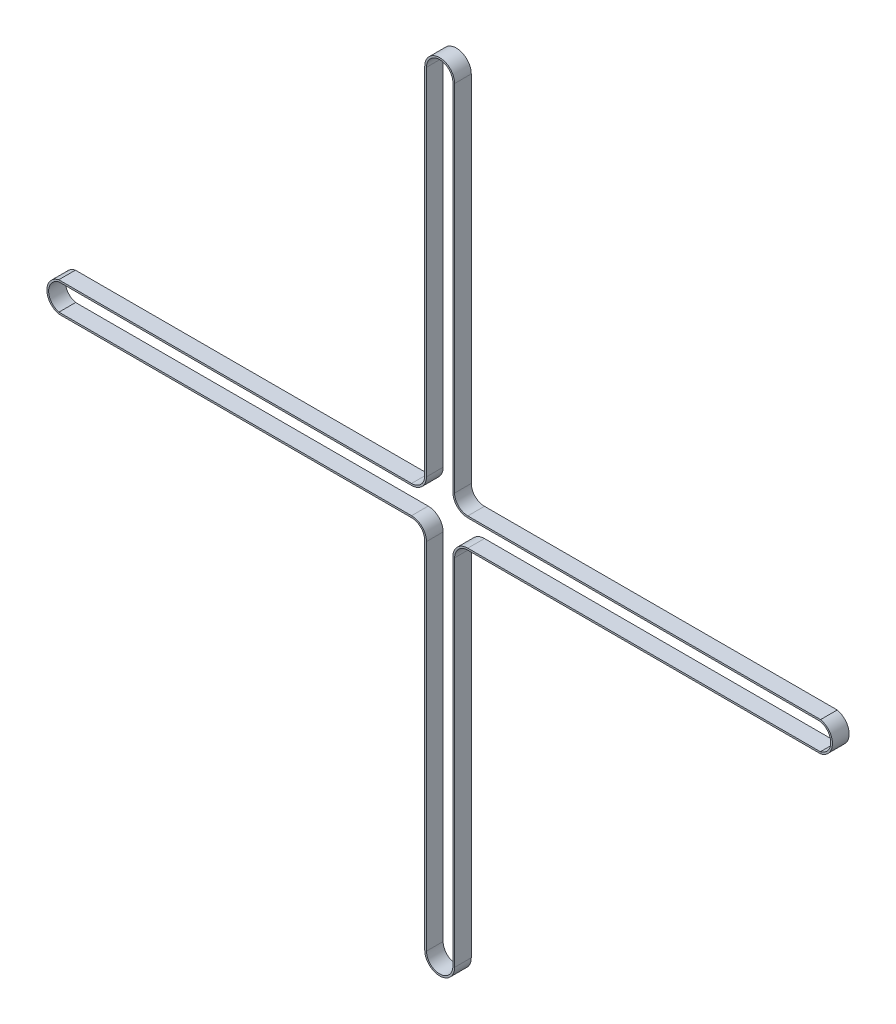
ISO-10303-21;
HEADER;
FILE_DESCRIPTION(('STEP AP214'),'2;1');
FILE_NAME('part.step','',(''),(''),'','','');
FILE_SCHEMA(('AUTOMOTIVE_DESIGN { 1 0 10303 214 1 1 1 1 }'));
ENDSEC;
DATA;
#1=APPLICATION_CONTEXT('core data for automotive mechanical design processes');
#2=APPLICATION_PROTOCOL_DEFINITION('international standard','automotive_design',2000,#1);
#3=PRODUCT_CONTEXT('',#1,'mechanical');
#4=PRODUCT('Part','Part','',(#3));
#5=PRODUCT_RELATED_PRODUCT_CATEGORY('part','',(#4));
#6=PRODUCT_DEFINITION_FORMATION('','',#4);
#7=PRODUCT_DEFINITION_CONTEXT('part definition',#1,'design');
#8=PRODUCT_DEFINITION('design','',#6,#7);
#9=PRODUCT_DEFINITION_SHAPE('','',#8);
#10=(LENGTH_UNIT() NAMED_UNIT(*) SI_UNIT(.MILLI.,.METRE.));
#11=(NAMED_UNIT(*) PLANE_ANGLE_UNIT() SI_UNIT($,.RADIAN.));
#12=(NAMED_UNIT(*) SI_UNIT($,.STERADIAN.) SOLID_ANGLE_UNIT());
#13=UNCERTAINTY_MEASURE_WITH_UNIT(LENGTH_MEASURE(1.E-05),#10,'distance_accuracy_value','');
#14=(GEOMETRIC_REPRESENTATION_CONTEXT(3) GLOBAL_UNCERTAINTY_ASSIGNED_CONTEXT((#13)) GLOBAL_UNIT_ASSIGNED_CONTEXT((#10,
#11,#12)) REPRESENTATION_CONTEXT('',''));
#15=CARTESIAN_POINT('',(0.,0.,0.));
#16=DIRECTION('',(0.,0.,1.));
#17=DIRECTION('',(1.,0.,0.));
#18=AXIS2_PLACEMENT_3D('',#15,#16,#17);
#19=CARTESIAN_POINT('',(0.,7.69421433221935,6.));
#20=DIRECTION('',(0.,0.,-1.));
#21=DIRECTION('',(-1.,0.,0.));
#22=AXIS2_PLACEMENT_3D('',#19,#20,#21);
#23=PLANE('',#22);
#24=CARTESIAN_POINT('',(0.,7.69421433221935,6.));
#25=DIRECTION('',(0.,0.,1.));
#26=DIRECTION('',(-1.,0.,0.));
#27=AXIS2_PLACEMENT_3D('',#24,#25,#26);
#28=CIRCLE('',#27,5.37999999999999);
#29=CARTESIAN_POINT('',(5.37999999999997,7.69421433221935,6.));
#30=VERTEX_POINT('',#29);
#31=CARTESIAN_POINT('',(-5.38,7.69421433221935,6.));
#32=VERTEX_POINT('',#31);
#33=EDGE_CURVE('E420',#30,#32,#28,.T.);
#34=ORIENTED_EDGE('',*,*,#33,.T.);
#35=DIRECTION('',(0.,-1.,0.));
#36=VECTOR('',#35,1.);
#37=CARTESIAN_POINT('',(-5.38,7.69421433221935,6.));
#38=LINE('',#37,#36);
#39=CARTESIAN_POINT('',(-5.38000000000002,-120.055785667781,6.));
#40=VERTEX_POINT('',#39);
#41=EDGE_CURVE('E424',#32,#40,#38,.T.);
#42=ORIENTED_EDGE('',*,*,#41,.T.);
#43=CARTESIAN_POINT('',(-10.13,-120.055785667781,6.));
#44=DIRECTION('',(0.,0.,-1.));
#45=DIRECTION('',(-1.,0.,0.));
#46=AXIS2_PLACEMENT_3D('',#43,#44,#45);
#47=CIRCLE('',#46,4.74999999999998);
#48=CARTESIAN_POINT('',(-10.13,-124.805785667781,6.));
#49=VERTEX_POINT('',#48);
#50=EDGE_CURVE('E428',#40,#49,#47,.T.);
#51=ORIENTED_EDGE('',*,*,#50,.T.);
#52=DIRECTION('',(-1.,0.,0.));
#53=VECTOR('',#52,1.);
#54=CARTESIAN_POINT('',(-10.13,-124.805785667781,6.));
#55=LINE('',#54,#53);
#56=CARTESIAN_POINT('',(-137.202114627931,-124.805785667781,6.));
#57=VERTEX_POINT('',#56);
#58=EDGE_CURVE('E431',#49,#57,#55,.T.);
#59=ORIENTED_EDGE('',*,*,#58,.T.);
#60=CARTESIAN_POINT('',(-136.,-130.152309811681,6.));
#61=DIRECTION('',(0.,0.,1.));
#62=DIRECTION('',(1.,0.,0.));
#63=AXIS2_PLACEMENT_3D('',#60,#61,#62);
#64=CIRCLE('',#63,5.48);
#65=CARTESIAN_POINT('',(-137.202114627931,-135.498833955582,6.));
#66=VERTEX_POINT('',#65);
#67=EDGE_CURVE('E434',#57,#66,#64,.T.);
#68=ORIENTED_EDGE('',*,*,#67,.T.);
#69=DIRECTION('',(1.,0.,0.));
#70=VECTOR('',#69,1.);
#71=CARTESIAN_POINT('',(-10.13,-135.498833955582,6.));
#72=LINE('',#71,#70);
#73=CARTESIAN_POINT('',(-10.13,-135.498833955582,6.));
#74=VERTEX_POINT('',#73);
#75=EDGE_CURVE('E437',#66,#74,#72,.T.);
#76=ORIENTED_EDGE('',*,*,#75,.T.);
#77=CARTESIAN_POINT('',(-10.13,-140.248833955582,6.));
#78=DIRECTION('',(0.,0.,-1.));
#79=DIRECTION('',(1.,0.,0.));
#80=AXIS2_PLACEMENT_3D('',#77,#78,#79);
#81=CIRCLE('',#80,4.75000000000002);
#82=CARTESIAN_POINT('',(-5.37999999999996,-140.248833955582,6.));
#83=VERTEX_POINT('',#82);
#84=EDGE_CURVE('E440',#74,#83,#81,.T.);
#85=ORIENTED_EDGE('',*,*,#84,.T.);
#86=DIRECTION('',(0.,-1.,0.));
#87=VECTOR('',#86,1.);
#88=CARTESIAN_POINT('',(-5.38000000000003,-267.998833955582,6.));
#89=LINE('',#88,#87);
#90=CARTESIAN_POINT('',(-5.38000000000003,-267.998833955582,6.));
#91=VERTEX_POINT('',#90);
#92=EDGE_CURVE('E443',#83,#91,#89,.T.);
#93=ORIENTED_EDGE('',*,*,#92,.T.);
#94=CARTESIAN_POINT('',(0.,-267.998833955582,6.));
#95=DIRECTION('',(0.,0.,1.));
#96=DIRECTION('',(1.,0.,0.));
#97=AXIS2_PLACEMENT_3D('',#94,#95,#96);
#98=CIRCLE('',#97,5.38000000000003);
#99=CARTESIAN_POINT('',(5.38000000000007,-267.998833955582,6.));
#100=VERTEX_POINT('',#99);
#101=EDGE_CURVE('E446',#91,#100,#98,.T.);
#102=ORIENTED_EDGE('',*,*,#101,.T.);
#103=DIRECTION('',(0.,1.,0.));
#104=VECTOR('',#103,1.);
#105=CARTESIAN_POINT('',(5.38000000000003,-267.998833955582,6.));
#106=LINE('',#105,#104);
#107=CARTESIAN_POINT('',(5.38000000000001,-140.248833955582,6.));
#108=VERTEX_POINT('',#107);
#109=EDGE_CURVE('E449',#100,#108,#106,.T.);
#110=ORIENTED_EDGE('',*,*,#109,.T.);
#111=CARTESIAN_POINT('',(10.13,-140.248833955582,6.));
#112=DIRECTION('',(0.,0.,-1.));
#113=DIRECTION('',(-1.,0.,0.));
#114=AXIS2_PLACEMENT_3D('',#111,#112,#113);
#115=CIRCLE('',#114,4.75000000000001);
#116=CARTESIAN_POINT('',(10.13,-135.498833955582,6.));
#117=VERTEX_POINT('',#116);
#118=EDGE_CURVE('E452',#108,#117,#115,.T.);
#119=ORIENTED_EDGE('',*,*,#118,.T.);
#120=DIRECTION('',(1.,0.,0.));
#121=VECTOR('',#120,1.);
#122=CARTESIAN_POINT('',(10.13,-135.498833955582,6.));
#123=LINE('',#122,#121);
#124=CARTESIAN_POINT('',(137.202114627931,-135.498833955582,6.));
#125=VERTEX_POINT('',#124);
#126=EDGE_CURVE('E455',#117,#125,#123,.T.);
#127=ORIENTED_EDGE('',*,*,#126,.T.);
#128=CARTESIAN_POINT('',(136.,-130.152309811681,6.));
#129=DIRECTION('',(0.,0.,1.));
#130=DIRECTION('',(-1.,0.,0.));
#131=AXIS2_PLACEMENT_3D('',#128,#129,#130);
#132=CIRCLE('',#131,5.47999999999999);
#133=CARTESIAN_POINT('',(137.202114627931,-124.805785667781,6.));
#134=VERTEX_POINT('',#133);
#135=EDGE_CURVE('E458',#125,#134,#132,.T.);
#136=ORIENTED_EDGE('',*,*,#135,.T.);
#137=DIRECTION('',(-1.,0.,0.));
#138=VECTOR('',#137,1.);
#139=CARTESIAN_POINT('',(10.13,-124.805785667781,6.));
#140=LINE('',#139,#138);
#141=CARTESIAN_POINT('',(10.13,-124.805785667781,6.));
#142=VERTEX_POINT('',#141);
#143=EDGE_CURVE('E461',#134,#142,#140,.T.);
#144=ORIENTED_EDGE('',*,*,#143,.T.);
#145=CARTESIAN_POINT('',(10.13,-120.055785667781,6.));
#146=DIRECTION('',(0.,0.,-1.));
#147=DIRECTION('',(1.,0.,0.));
#148=AXIS2_PLACEMENT_3D('',#145,#146,#147);
#149=CIRCLE('',#148,4.75000000000001);
#150=CARTESIAN_POINT('',(5.38000000000001,-120.055785667781,6.));
#151=VERTEX_POINT('',#150);
#152=EDGE_CURVE('E464',#142,#151,#149,.T.);
#153=ORIENTED_EDGE('',*,*,#152,.T.);
#154=DIRECTION('',(0.,1.,0.));
#155=VECTOR('',#154,1.);
#156=CARTESIAN_POINT('',(5.37999999999997,7.69421433221935,6.));
#157=LINE('',#156,#155);
#158=EDGE_CURVE('E467',#151,#30,#157,.T.);
#159=ORIENTED_EDGE('',*,*,#158,.T.);
#160=EDGE_LOOP('',(#34,#42,#51,#59,#68,#76,#85,#93,#102,#110,#119,#127,#136,#144,#153,#159));
#161=FACE_BOUND('',#160,.T.);
#162=CARTESIAN_POINT('',(0.,7.69421433221935,6.));
#163=DIRECTION('',(0.,0.,1.));
#164=DIRECTION('',(-1.,0.,0.));
#165=AXIS2_PLACEMENT_3D('',#162,#163,#164);
#166=CIRCLE('',#165,4.75);
#167=CARTESIAN_POINT('',(4.75,7.69421433221935,6.));
#168=VERTEX_POINT('',#167);
#169=CARTESIAN_POINT('',(-4.75,7.69421433221935,6.));
#170=VERTEX_POINT('',#169);
#171=EDGE_CURVE('E251',#168,#170,#166,.T.);
#172=ORIENTED_EDGE('',*,*,#171,.F.);
#173=DIRECTION('',(0.,1.,0.));
#174=VECTOR('',#173,1.);
#175=CARTESIAN_POINT('',(4.75,7.69421433221935,6.));
#176=LINE('',#175,#174);
#177=CARTESIAN_POINT('',(4.75000000000005,-120.055785667781,6.));
#178=VERTEX_POINT('',#177);
#179=EDGE_CURVE('E316',#178,#168,#176,.T.);
#180=ORIENTED_EDGE('',*,*,#179,.F.);
#181=CARTESIAN_POINT('',(10.13,-120.055785667781,6.));
#182=DIRECTION('',(0.,0.,-1.));
#183=DIRECTION('',(1.,0.,0.));
#184=AXIS2_PLACEMENT_3D('',#181,#182,#183);
#185=CIRCLE('',#184,5.37999999999998);
#186=CARTESIAN_POINT('',(10.13,-125.435785667781,6.));
#187=VERTEX_POINT('',#186);
#188=EDGE_CURVE('E313',#187,#178,#185,.T.);
#189=ORIENTED_EDGE('',*,*,#188,.F.);
#190=DIRECTION('',(-1.,0.,0.));
#191=VECTOR('',#190,1.);
#192=CARTESIAN_POINT('',(10.13,-125.435785667781,6.));
#193=LINE('',#192,#191);
#194=CARTESIAN_POINT('',(137.13,-125.43578566778,6.));
#195=VERTEX_POINT('',#194);
#196=EDGE_CURVE('E310',#195,#187,#193,.T.);
#197=ORIENTED_EDGE('',*,*,#196,.F.);
#198=CARTESIAN_POINT('',(136.,-130.152309811681,6.));
#199=DIRECTION('',(0.,0.,1.));
#200=DIRECTION('',(-1.,0.,0.));
#201=AXIS2_PLACEMENT_3D('',#198,#199,#200);
#202=CIRCLE('',#201,4.84999999999998);
#203=CARTESIAN_POINT('',(137.13,-134.868833955582,6.));
#204=VERTEX_POINT('',#203);
#205=EDGE_CURVE('E307',#204,#195,#202,.T.);
#206=ORIENTED_EDGE('',*,*,#205,.F.);
#207=DIRECTION('',(1.,0.,0.));
#208=VECTOR('',#207,1.);
#209=CARTESIAN_POINT('',(10.13,-134.868833955582,6.));
#210=LINE('',#209,#208);
#211=CARTESIAN_POINT('',(10.13,-134.868833955582,6.));
#212=VERTEX_POINT('',#211);
#213=EDGE_CURVE('E304',#212,#204,#210,.T.);
#214=ORIENTED_EDGE('',*,*,#213,.F.);
#215=CARTESIAN_POINT('',(10.13,-140.248833955582,6.));
#216=DIRECTION('',(0.,0.,-1.));
#217=DIRECTION('',(-1.,0.,0.));
#218=AXIS2_PLACEMENT_3D('',#215,#216,#217);
#219=CIRCLE('',#218,5.38);
#220=CARTESIAN_POINT('',(4.75000000000005,-140.248833955582,6.));
#221=VERTEX_POINT('',#220);
#222=EDGE_CURVE('E301',#221,#212,#219,.T.);
#223=ORIENTED_EDGE('',*,*,#222,.F.);
#224=DIRECTION('',(0.,1.,0.));
#225=VECTOR('',#224,1.);
#226=CARTESIAN_POINT('',(4.75000000000004,-267.998833955582,6.));
#227=LINE('',#226,#225);
#228=CARTESIAN_POINT('',(4.75000000000003,-267.998833955582,6.));
#229=VERTEX_POINT('',#228);
#230=EDGE_CURVE('E298',#229,#221,#227,.T.);
#231=ORIENTED_EDGE('',*,*,#230,.F.);
#232=CARTESIAN_POINT('',(0.,-267.998833955582,6.));
#233=DIRECTION('',(0.,0.,1.));
#234=DIRECTION('',(1.,0.,0.));
#235=AXIS2_PLACEMENT_3D('',#232,#233,#234);
#236=CIRCLE('',#235,4.75);
#237=CARTESIAN_POINT('',(-4.74999999999997,-267.998833955582,6.));
#238=VERTEX_POINT('',#237);
#239=EDGE_CURVE('E295',#238,#229,#236,.T.);
#240=ORIENTED_EDGE('',*,*,#239,.F.);
#241=DIRECTION('',(0.,-1.,0.));
#242=VECTOR('',#241,1.);
#243=CARTESIAN_POINT('',(-4.74999999999997,-267.998833955582,6.));
#244=LINE('',#243,#242);
#245=CARTESIAN_POINT('',(-4.74999999999998,-140.248833955582,6.));
#246=VERTEX_POINT('',#245);
#247=EDGE_CURVE('E292',#246,#238,#244,.T.);
#248=ORIENTED_EDGE('',*,*,#247,.F.);
#249=CARTESIAN_POINT('',(-10.13,-140.248833955582,6.));
#250=DIRECTION('',(0.,0.,-1.));
#251=DIRECTION('',(1.,0.,0.));
#252=AXIS2_PLACEMENT_3D('',#249,#250,#251);
#253=CIRCLE('',#252,5.38);
#254=CARTESIAN_POINT('',(-10.13,-134.868833955582,6.));
#255=VERTEX_POINT('',#254);
#256=EDGE_CURVE('E289',#255,#246,#253,.T.);
#257=ORIENTED_EDGE('',*,*,#256,.F.);
#258=DIRECTION('',(1.,0.,0.));
#259=VECTOR('',#258,1.);
#260=CARTESIAN_POINT('',(-10.13,-134.868833955582,6.));
#261=LINE('',#260,#259);
#262=CARTESIAN_POINT('',(-137.13,-134.868833955582,6.));
#263=VERTEX_POINT('',#262);
#264=EDGE_CURVE('E286',#263,#255,#261,.T.);
#265=ORIENTED_EDGE('',*,*,#264,.F.);
#266=CARTESIAN_POINT('',(-136.,-130.152309811681,6.));
#267=DIRECTION('',(0.,0.,1.));
#268=DIRECTION('',(1.,0.,0.));
#269=AXIS2_PLACEMENT_3D('',#266,#267,#268);
#270=CIRCLE('',#269,4.84999999999998);
#271=CARTESIAN_POINT('',(-137.13,-125.435785667781,6.));
#272=VERTEX_POINT('',#271);
#273=EDGE_CURVE('E283',#272,#263,#270,.T.);
#274=ORIENTED_EDGE('',*,*,#273,.F.);
#275=DIRECTION('',(-1.,0.,0.));
#276=VECTOR('',#275,1.);
#277=CARTESIAN_POINT('',(-10.13,-125.435785667781,6.));
#278=LINE('',#277,#276);
#279=CARTESIAN_POINT('',(-10.13,-125.435785667781,6.));
#280=VERTEX_POINT('',#279);
#281=EDGE_CURVE('E278',#280,#272,#278,.T.);
#282=ORIENTED_EDGE('',*,*,#281,.F.);
#283=CARTESIAN_POINT('',(-10.13,-120.055785667781,6.));
#284=DIRECTION('',(0.,0.,-1.));
#285=DIRECTION('',(-1.,0.,0.));
#286=AXIS2_PLACEMENT_3D('',#283,#284,#285);
#287=CIRCLE('',#286,5.37999999999998);
#288=CARTESIAN_POINT('',(-4.75000000000002,-120.055785667781,6.));
#289=VERTEX_POINT('',#288);
#290=EDGE_CURVE('E274',#289,#280,#287,.T.);
#291=ORIENTED_EDGE('',*,*,#290,.F.);
#292=DIRECTION('',(0.,-1.,0.));
#293=VECTOR('',#292,1.);
#294=CARTESIAN_POINT('',(-4.75,7.69421433221935,6.));
#295=LINE('',#294,#293);
#296=EDGE_CURVE('E260',#170,#289,#295,.T.);
#297=ORIENTED_EDGE('',*,*,#296,.F.);
#298=EDGE_LOOP('',(#172,#180,#189,#197,#206,#214,#223,#231,#240,#248,#257,#265,#274,#282,#291,#297));
#299=FACE_BOUND('',#298,.T.);
#300=ADVANCED_FACE('F41',(#161,#299),#23,.F.);
#301=CARTESIAN_POINT('',(0.,7.69421433221935,0.));
#302=DIRECTION('',(0.,0.,-1.));
#303=DIRECTION('',(-1.,0.,0.));
#304=AXIS2_PLACEMENT_3D('',#301,#302,#303);
#305=PLANE('',#304);
#306=CARTESIAN_POINT('',(0.,7.69421433221935,0.));
#307=DIRECTION('',(0.,0.,1.));
#308=DIRECTION('',(-1.,0.,0.));
#309=AXIS2_PLACEMENT_3D('',#306,#307,#308);
#310=CIRCLE('',#309,5.37999999999999);
#311=CARTESIAN_POINT('',(5.37999999999997,7.69421433221935,0.));
#312=VERTEX_POINT('',#311);
#313=CARTESIAN_POINT('',(-5.38,7.69421433221935,0.));
#314=VERTEX_POINT('',#313);
#315=EDGE_CURVE('E269',#312,#314,#310,.T.);
#316=ORIENTED_EDGE('',*,*,#315,.F.);
#317=DIRECTION('',(0.,1.,0.));
#318=VECTOR('',#317,1.);
#319=CARTESIAN_POINT('',(5.37999999999997,7.69421433221935,0.));
#320=LINE('',#319,#318);
#321=CARTESIAN_POINT('',(5.38000000000001,-120.055785667781,0.));
#322=VERTEX_POINT('',#321);
#323=EDGE_CURVE('E425',#322,#312,#320,.T.);
#324=ORIENTED_EDGE('',*,*,#323,.F.);
#325=CARTESIAN_POINT('',(10.13,-120.055785667781,0.));
#326=DIRECTION('',(0.,0.,-1.));
#327=DIRECTION('',(1.,0.,0.));
#328=AXIS2_PLACEMENT_3D('',#325,#326,#327);
#329=CIRCLE('',#328,4.75000000000001);
#330=CARTESIAN_POINT('',(10.13,-124.805785667781,0.));
#331=VERTEX_POINT('',#330);
#332=EDGE_CURVE('E513',#331,#322,#329,.T.);
#333=ORIENTED_EDGE('',*,*,#332,.F.);
#334=DIRECTION('',(-1.,0.,0.));
#335=VECTOR('',#334,1.);
#336=CARTESIAN_POINT('',(10.13,-124.805785667781,0.));
#337=LINE('',#336,#335);
#338=CARTESIAN_POINT('',(137.202114627931,-124.805785667781,0.));
#339=VERTEX_POINT('',#338);
#340=EDGE_CURVE('E510',#339,#331,#337,.T.);
#341=ORIENTED_EDGE('',*,*,#340,.F.);
#342=CARTESIAN_POINT('',(136.,-130.152309811681,0.));
#343=DIRECTION('',(0.,0.,1.));
#344=DIRECTION('',(-1.,0.,0.));
#345=AXIS2_PLACEMENT_3D('',#342,#343,#344);
#346=CIRCLE('',#345,5.47999999999999);
#347=CARTESIAN_POINT('',(137.202114627931,-135.498833955582,0.));
#348=VERTEX_POINT('',#347);
#349=EDGE_CURVE('E507',#348,#339,#346,.T.);
#350=ORIENTED_EDGE('',*,*,#349,.F.);
#351=DIRECTION('',(1.,0.,0.));
#352=VECTOR('',#351,1.);
#353=CARTESIAN_POINT('',(10.13,-135.498833955582,0.));
#354=LINE('',#353,#352);
#355=CARTESIAN_POINT('',(10.13,-135.498833955582,0.));
#356=VERTEX_POINT('',#355);
#357=EDGE_CURVE('E504',#356,#348,#354,.T.);
#358=ORIENTED_EDGE('',*,*,#357,.F.);
#359=CARTESIAN_POINT('',(10.13,-140.248833955582,0.));
#360=DIRECTION('',(0.,0.,-1.));
#361=DIRECTION('',(-1.,0.,0.));
#362=AXIS2_PLACEMENT_3D('',#359,#360,#361);
#363=CIRCLE('',#362,4.75000000000001);
#364=CARTESIAN_POINT('',(5.38000000000001,-140.248833955582,0.));
#365=VERTEX_POINT('',#364);
#366=EDGE_CURVE('E501',#365,#356,#363,.T.);
#367=ORIENTED_EDGE('',*,*,#366,.F.);
#368=DIRECTION('',(0.,1.,0.));
#369=VECTOR('',#368,1.);
#370=CARTESIAN_POINT('',(5.38000000000003,-267.998833955582,0.));
#371=LINE('',#370,#369);
#372=CARTESIAN_POINT('',(5.38000000000007,-267.998833955582,0.));
#373=VERTEX_POINT('',#372);
#374=EDGE_CURVE('E498',#373,#365,#371,.T.);
#375=ORIENTED_EDGE('',*,*,#374,.F.);
#376=CARTESIAN_POINT('',(0.,-267.998833955582,0.));
#377=DIRECTION('',(0.,0.,1.));
#378=DIRECTION('',(1.,0.,0.));
#379=AXIS2_PLACEMENT_3D('',#376,#377,#378);
#380=CIRCLE('',#379,5.38000000000003);
#381=CARTESIAN_POINT('',(-5.38000000000003,-267.998833955582,0.));
#382=VERTEX_POINT('',#381);
#383=EDGE_CURVE('E495',#382,#373,#380,.T.);
#384=ORIENTED_EDGE('',*,*,#383,.F.);
#385=DIRECTION('',(0.,-1.,0.));
#386=VECTOR('',#385,1.);
#387=CARTESIAN_POINT('',(-5.38000000000003,-267.998833955582,0.));
#388=LINE('',#387,#386);
#389=CARTESIAN_POINT('',(-5.37999999999996,-140.248833955582,0.));
#390=VERTEX_POINT('',#389);
#391=EDGE_CURVE('E492',#390,#382,#388,.T.);
#392=ORIENTED_EDGE('',*,*,#391,.F.);
#393=CARTESIAN_POINT('',(-10.13,-140.248833955582,0.));
#394=DIRECTION('',(0.,0.,-1.));
#395=DIRECTION('',(1.,0.,0.));
#396=AXIS2_PLACEMENT_3D('',#393,#394,#395);
#397=CIRCLE('',#396,4.75000000000002);
#398=CARTESIAN_POINT('',(-10.13,-135.498833955582,0.));
#399=VERTEX_POINT('',#398);
#400=EDGE_CURVE('E489',#399,#390,#397,.T.);
#401=ORIENTED_EDGE('',*,*,#400,.F.);
#402=DIRECTION('',(1.,0.,0.));
#403=VECTOR('',#402,1.);
#404=CARTESIAN_POINT('',(-10.13,-135.498833955582,0.));
#405=LINE('',#404,#403);
#406=CARTESIAN_POINT('',(-137.202114627931,-135.498833955582,0.));
#407=VERTEX_POINT('',#406);
#408=EDGE_CURVE('E486',#407,#399,#405,.T.);
#409=ORIENTED_EDGE('',*,*,#408,.F.);
#410=CARTESIAN_POINT('',(-136.,-130.152309811681,0.));
#411=DIRECTION('',(0.,0.,1.));
#412=DIRECTION('',(1.,0.,0.));
#413=AXIS2_PLACEMENT_3D('',#410,#411,#412);
#414=CIRCLE('',#413,5.48);
#415=CARTESIAN_POINT('',(-137.202114627931,-124.805785667781,0.));
#416=VERTEX_POINT('',#415);
#417=EDGE_CURVE('E483',#416,#407,#414,.T.);
#418=ORIENTED_EDGE('',*,*,#417,.F.);
#419=DIRECTION('',(-1.,0.,0.));
#420=VECTOR('',#419,1.);
#421=CARTESIAN_POINT('',(-10.13,-124.805785667781,0.));
#422=LINE('',#421,#420);
#423=CARTESIAN_POINT('',(-10.13,-124.805785667781,0.));
#424=VERTEX_POINT('',#423);
#425=EDGE_CURVE('E480',#424,#416,#422,.T.);
#426=ORIENTED_EDGE('',*,*,#425,.F.);
#427=CARTESIAN_POINT('',(-10.13,-120.055785667781,0.));
#428=DIRECTION('',(0.,0.,-1.));
#429=DIRECTION('',(-1.,0.,0.));
#430=AXIS2_PLACEMENT_3D('',#427,#428,#429);
#431=CIRCLE('',#430,4.74999999999998);
#432=CARTESIAN_POINT('',(-5.38000000000002,-120.055785667781,0.));
#433=VERTEX_POINT('',#432);
#434=EDGE_CURVE('E477',#433,#424,#431,.T.);
#435=ORIENTED_EDGE('',*,*,#434,.F.);
#436=DIRECTION('',(0.,-1.,0.));
#437=VECTOR('',#436,1.);
#438=CARTESIAN_POINT('',(-5.38,7.69421433221935,0.));
#439=LINE('',#438,#437);
#440=EDGE_CURVE('E474',#314,#433,#439,.T.);
#441=ORIENTED_EDGE('',*,*,#440,.F.);
#442=EDGE_LOOP('',(#316,#324,#333,#341,#350,#358,#367,#375,#384,#392,#401,#409,#418,#426,#435,#441));
#443=FACE_BOUND('',#442,.T.);
#444=DIRECTION('',(0.,1.,0.));
#445=VECTOR('',#444,1.);
#446=CARTESIAN_POINT('',(4.75,7.69421433221935,0.));
#447=LINE('',#446,#445);
#448=CARTESIAN_POINT('',(4.75000000000003,-120.055785667781,0.));
#449=VERTEX_POINT('',#448);
#450=CARTESIAN_POINT('',(4.75,7.69421433221935,0.));
#451=VERTEX_POINT('',#450);
#452=EDGE_CURVE('E261',#449,#451,#447,.T.);
#453=ORIENTED_EDGE('',*,*,#452,.T.);
#454=CARTESIAN_POINT('',(0.,7.69421433221935,0.));
#455=DIRECTION('',(0.,0.,1.));
#456=DIRECTION('',(-1.,0.,0.));
#457=AXIS2_PLACEMENT_3D('',#454,#455,#456);
#458=CIRCLE('',#457,4.75);
#459=CARTESIAN_POINT('',(-4.75,7.69421433221935,0.));
#460=VERTEX_POINT('',#459);
#461=EDGE_CURVE('E65',#451,#460,#458,.T.);
#462=ORIENTED_EDGE('',*,*,#461,.T.);
#463=DIRECTION('',(0.,-1.,0.));
#464=VECTOR('',#463,1.);
#465=CARTESIAN_POINT('',(-4.75,7.69421433221935,0.));
#466=LINE('',#465,#464);
#467=CARTESIAN_POINT('',(-4.75000000000002,-120.055785667781,0.));
#468=VERTEX_POINT('',#467);
#469=EDGE_CURVE('E267',#460,#468,#466,.T.);
#470=ORIENTED_EDGE('',*,*,#469,.T.);
#471=CARTESIAN_POINT('',(-10.13,-120.055785667781,0.));
#472=DIRECTION('',(0.,0.,-1.));
#473=DIRECTION('',(-1.,0.,0.));
#474=AXIS2_PLACEMENT_3D('',#471,#472,#473);
#475=CIRCLE('',#474,5.37999999999998);
#476=CARTESIAN_POINT('',(-10.13,-125.435785667781,0.));
#477=VERTEX_POINT('',#476);
#478=EDGE_CURVE('E323',#468,#477,#475,.T.);
#479=ORIENTED_EDGE('',*,*,#478,.T.);
#480=DIRECTION('',(-1.,0.,0.));
#481=VECTOR('',#480,1.);
#482=CARTESIAN_POINT('',(-10.13,-125.435785667781,0.));
#483=LINE('',#482,#481);
#484=CARTESIAN_POINT('',(-137.13,-125.435785667781,0.));
#485=VERTEX_POINT('',#484);
#486=EDGE_CURVE('E327',#477,#485,#483,.T.);
#487=ORIENTED_EDGE('',*,*,#486,.T.);
#488=CARTESIAN_POINT('',(-136.,-130.152309811681,0.));
#489=DIRECTION('',(0.,0.,1.));
#490=DIRECTION('',(1.,0.,0.));
#491=AXIS2_PLACEMENT_3D('',#488,#489,#490);
#492=CIRCLE('',#491,4.84999999999998);
#493=CARTESIAN_POINT('',(-137.13,-134.868833955582,0.));
#494=VERTEX_POINT('',#493);
#495=EDGE_CURVE('E331',#485,#494,#492,.T.);
#496=ORIENTED_EDGE('',*,*,#495,.T.);
#497=DIRECTION('',(1.,0.,0.));
#498=VECTOR('',#497,1.);
#499=CARTESIAN_POINT('',(-10.13,-134.868833955582,0.));
#500=LINE('',#499,#498);
#501=CARTESIAN_POINT('',(-10.13,-134.868833955582,0.));
#502=VERTEX_POINT('',#501);
#503=EDGE_CURVE('E335',#494,#502,#500,.T.);
#504=ORIENTED_EDGE('',*,*,#503,.T.);
#505=CARTESIAN_POINT('',(-10.13,-140.248833955582,0.));
#506=DIRECTION('',(0.,0.,-1.));
#507=DIRECTION('',(1.,0.,0.));
#508=AXIS2_PLACEMENT_3D('',#505,#506,#507);
#509=CIRCLE('',#508,5.38);
#510=CARTESIAN_POINT('',(-4.74999999999998,-140.248833955582,0.));
#511=VERTEX_POINT('',#510);
#512=EDGE_CURVE('E339',#502,#511,#509,.T.);
#513=ORIENTED_EDGE('',*,*,#512,.T.);
#514=DIRECTION('',(0.,-1.,0.));
#515=VECTOR('',#514,1.);
#516=CARTESIAN_POINT('',(-4.74999999999997,-267.998833955582,0.));
#517=LINE('',#516,#515);
#518=CARTESIAN_POINT('',(-4.74999999999997,-267.998833955582,0.));
#519=VERTEX_POINT('',#518);
#520=EDGE_CURVE('E343',#511,#519,#517,.T.);
#521=ORIENTED_EDGE('',*,*,#520,.T.);
#522=CARTESIAN_POINT('',(0.,-267.998833955582,0.));
#523=DIRECTION('',(0.,0.,1.));
#524=DIRECTION('',(1.,0.,0.));
#525=AXIS2_PLACEMENT_3D('',#522,#523,#524);
#526=CIRCLE('',#525,4.75);
#527=CARTESIAN_POINT('',(4.75000000000003,-267.998833955582,0.));
#528=VERTEX_POINT('',#527);
#529=EDGE_CURVE('E347',#519,#528,#526,.T.);
#530=ORIENTED_EDGE('',*,*,#529,.T.);
#531=DIRECTION('',(0.,1.,0.));
#532=VECTOR('',#531,1.);
#533=CARTESIAN_POINT('',(4.75000000000004,-267.998833955582,0.));
#534=LINE('',#533,#532);
#535=CARTESIAN_POINT('',(4.75000000000005,-140.248833955582,0.));
#536=VERTEX_POINT('',#535);
#537=EDGE_CURVE('E351',#528,#536,#534,.T.);
#538=ORIENTED_EDGE('',*,*,#537,.T.);
#539=CARTESIAN_POINT('',(10.13,-140.248833955582,0.));
#540=DIRECTION('',(0.,0.,-1.));
#541=DIRECTION('',(-1.,0.,0.));
#542=AXIS2_PLACEMENT_3D('',#539,#540,#541);
#543=CIRCLE('',#542,5.38);
#544=CARTESIAN_POINT('',(10.13,-134.868833955582,0.));
#545=VERTEX_POINT('',#544);
#546=EDGE_CURVE('E355',#536,#545,#543,.T.);
#547=ORIENTED_EDGE('',*,*,#546,.T.);
#548=DIRECTION('',(1.,0.,0.));
#549=VECTOR('',#548,1.);
#550=CARTESIAN_POINT('',(10.13,-134.868833955582,0.));
#551=LINE('',#550,#549);
#552=CARTESIAN_POINT('',(137.13,-134.868833955582,0.));
#553=VERTEX_POINT('',#552);
#554=EDGE_CURVE('E359',#545,#553,#551,.T.);
#555=ORIENTED_EDGE('',*,*,#554,.T.);
#556=CARTESIAN_POINT('',(136.,-130.152309811681,0.));
#557=DIRECTION('',(0.,0.,1.));
#558=DIRECTION('',(-1.,0.,0.));
#559=AXIS2_PLACEMENT_3D('',#556,#557,#558);
#560=CIRCLE('',#559,4.84999999999998);
#561=CARTESIAN_POINT('',(137.13,-125.43578566778,0.));
#562=VERTEX_POINT('',#561);
#563=EDGE_CURVE('E363',#553,#562,#560,.T.);
#564=ORIENTED_EDGE('',*,*,#563,.T.);
#565=DIRECTION('',(-1.,0.,0.));
#566=VECTOR('',#565,1.);
#567=CARTESIAN_POINT('',(10.13,-125.435785667781,0.));
#568=LINE('',#567,#566);
#569=CARTESIAN_POINT('',(10.13,-125.435785667781,0.));
#570=VERTEX_POINT('',#569);
#571=EDGE_CURVE('E367',#562,#570,#568,.T.);
#572=ORIENTED_EDGE('',*,*,#571,.T.);
#573=CARTESIAN_POINT('',(10.13,-120.055785667781,0.));
#574=DIRECTION('',(0.,0.,-1.));
#575=DIRECTION('',(1.,0.,0.));
#576=AXIS2_PLACEMENT_3D('',#573,#574,#575);
#577=CIRCLE('',#576,5.37999999999998);
#578=EDGE_CURVE('E371',#570,#449,#577,.T.);
#579=ORIENTED_EDGE('',*,*,#578,.T.);
#580=EDGE_LOOP('',(#453,#462,#470,#479,#487,#496,#504,#513,#521,#530,#538,#547,#555,#564,#572,#579));
#581=FACE_BOUND('',#580,.T.);
#582=ADVANCED_FACE('F584',(#443,#581),#305,.T.);
#583=CARTESIAN_POINT('',(0.,7.69421433221935,6.));
#584=DIRECTION('',(0.,0.,-1.));
#585=DIRECTION('',(-1.,0.,0.));
#586=AXIS2_PLACEMENT_3D('',#583,#584,#585);
#587=CYLINDRICAL_SURFACE('',#586,5.37999999999999);
#588=ORIENTED_EDGE('',*,*,#315,.T.);
#589=DIRECTION('',(0.,0.,-1.));
#590=VECTOR('',#589,1.);
#591=CARTESIAN_POINT('',(-5.38,7.69421433221935,6.));
#592=LINE('',#591,#590);
#593=EDGE_CURVE('E11',#32,#314,#592,.T.);
#594=ORIENTED_EDGE('',*,*,#593,.F.);
#595=ORIENTED_EDGE('',*,*,#33,.F.);
#596=DIRECTION('',(0.,0.,-1.));
#597=VECTOR('',#596,1.);
#598=CARTESIAN_POINT('',(5.37999999999997,7.69421433221935,6.));
#599=LINE('',#598,#597);
#600=EDGE_CURVE('E470',#30,#312,#599,.T.);
#601=ORIENTED_EDGE('',*,*,#600,.T.);
#602=EDGE_LOOP('',(#588,#594,#595,#601));
#603=FACE_BOUND('',#602,.T.);
#604=ADVANCED_FACE('F43',(#603),#587,.T.);
#605=CARTESIAN_POINT('',(-5.38,7.69421433221935,6.));
#606=DIRECTION('',(1.,0.,0.));
#607=DIRECTION('',(0.,1.,0.));
#608=AXIS2_PLACEMENT_3D('',#605,#606,#607);
#609=PLANE('',#608);
#610=ORIENTED_EDGE('',*,*,#440,.T.);
#611=DIRECTION('',(0.,0.,-1.));
#612=VECTOR('',#611,1.);
#613=CARTESIAN_POINT('',(-5.38000000000002,-120.055785667781,6.));
#614=LINE('',#613,#612);
#615=EDGE_CURVE('E50',#40,#433,#614,.T.);
#616=ORIENTED_EDGE('',*,*,#615,.F.);
#617=ORIENTED_EDGE('',*,*,#41,.F.);
#618=ORIENTED_EDGE('',*,*,#593,.T.);
#619=EDGE_LOOP('',(#610,#616,#617,#618));
#620=FACE_BOUND('',#619,.T.);
#621=ADVANCED_FACE('F601',(#620),#609,.F.);
#622=CARTESIAN_POINT('',(-10.13,-120.055785667781,6.));
#623=DIRECTION('',(0.,0.,-1.));
#624=DIRECTION('',(-1.,0.,0.));
#625=AXIS2_PLACEMENT_3D('',#622,#623,#624);
#626=CYLINDRICAL_SURFACE('',#625,4.74999999999998);
#627=ORIENTED_EDGE('',*,*,#434,.T.);
#628=DIRECTION('',(0.,0.,-1.));
#629=VECTOR('',#628,1.);
#630=CARTESIAN_POINT('',(-10.13,-124.805785667781,6.));
#631=LINE('',#630,#629);
#632=EDGE_CURVE('E569',#49,#424,#631,.T.);
#633=ORIENTED_EDGE('',*,*,#632,.F.);
#634=ORIENTED_EDGE('',*,*,#50,.F.);
#635=ORIENTED_EDGE('',*,*,#615,.T.);
#636=EDGE_LOOP('',(#627,#633,#634,#635));
#637=FACE_BOUND('',#636,.T.);
#638=ADVANCED_FACE('F578',(#637),#626,.F.);
#639=CARTESIAN_POINT('',(-10.13,-124.805785667781,6.));
#640=DIRECTION('',(0.,-1.,0.));
#641=DIRECTION('',(0.,0.,-1.));
#642=AXIS2_PLACEMENT_3D('',#639,#640,#641);
#643=PLANE('',#642);
#644=ORIENTED_EDGE('',*,*,#425,.T.);
#645=DIRECTION('',(0.,0.,-1.));
#646=VECTOR('',#645,1.);
#647=CARTESIAN_POINT('',(-137.202114627931,-124.805785667781,6.));
#648=LINE('',#647,#646);
#649=EDGE_CURVE('E565',#57,#416,#648,.T.);
#650=ORIENTED_EDGE('',*,*,#649,.F.);
#651=ORIENTED_EDGE('',*,*,#58,.F.);
#652=ORIENTED_EDGE('',*,*,#632,.T.);
#653=EDGE_LOOP('',(#644,#650,#651,#652));
#654=FACE_BOUND('',#653,.T.);
#655=ADVANCED_FACE('F590',(#654),#643,.F.);
#656=CARTESIAN_POINT('',(-136.,-130.152309811681,6.));
#657=DIRECTION('',(0.,0.,-1.));
#658=DIRECTION('',(-1.,0.,0.));
#659=AXIS2_PLACEMENT_3D('',#656,#657,#658);
#660=CYLINDRICAL_SURFACE('',#659,5.48);
#661=ORIENTED_EDGE('',*,*,#417,.T.);
#662=DIRECTION('',(0.,0.,-1.));
#663=VECTOR('',#662,1.);
#664=CARTESIAN_POINT('',(-137.202114627931,-135.498833955582,6.));
#665=LINE('',#664,#663);
#666=EDGE_CURVE('E561',#66,#407,#665,.T.);
#667=ORIENTED_EDGE('',*,*,#666,.F.);
#668=ORIENTED_EDGE('',*,*,#67,.F.);
#669=ORIENTED_EDGE('',*,*,#649,.T.);
#670=EDGE_LOOP('',(#661,#667,#668,#669));
#671=FACE_BOUND('',#670,.T.);
#672=ADVANCED_FACE('F594',(#671),#660,.T.);
#673=CARTESIAN_POINT('',(-10.13,-135.498833955582,6.));
#674=DIRECTION('',(0.,1.,0.));
#675=DIRECTION('',(-1.,0.,0.));
#676=AXIS2_PLACEMENT_3D('',#673,#674,#675);
#677=PLANE('',#676);
#678=ORIENTED_EDGE('',*,*,#408,.T.);
#679=DIRECTION('',(0.,0.,-1.));
#680=VECTOR('',#679,1.);
#681=CARTESIAN_POINT('',(-10.13,-135.498833955582,6.));
#682=LINE('',#681,#680);
#683=EDGE_CURVE('E557',#74,#399,#682,.T.);
#684=ORIENTED_EDGE('',*,*,#683,.F.);
#685=ORIENTED_EDGE('',*,*,#75,.F.);
#686=ORIENTED_EDGE('',*,*,#666,.T.);
#687=EDGE_LOOP('',(#678,#684,#685,#686));
#688=FACE_BOUND('',#687,.T.);
#689=ADVANCED_FACE('F654',(#688),#677,.F.);
#690=CARTESIAN_POINT('',(-10.13,-140.248833955582,6.));
#691=DIRECTION('',(0.,0.,-1.));
#692=DIRECTION('',(-1.,0.,0.));
#693=AXIS2_PLACEMENT_3D('',#690,#691,#692);
#694=CYLINDRICAL_SURFACE('',#693,4.75000000000002);
#695=ORIENTED_EDGE('',*,*,#400,.T.);
#696=DIRECTION('',(0.,0.,-1.));
#697=VECTOR('',#696,1.);
#698=CARTESIAN_POINT('',(-5.37999999999996,-140.248833955582,6.));
#699=LINE('',#698,#697);
#700=EDGE_CURVE('E553',#83,#390,#699,.T.);
#701=ORIENTED_EDGE('',*,*,#700,.F.);
#702=ORIENTED_EDGE('',*,*,#84,.F.);
#703=ORIENTED_EDGE('',*,*,#683,.T.);
#704=EDGE_LOOP('',(#695,#701,#702,#703));
#705=FACE_BOUND('',#704,.T.);
#706=ADVANCED_FACE('F651',(#705),#694,.F.);
#707=CARTESIAN_POINT('',(-5.38000000000003,-267.998833955582,6.));
#708=DIRECTION('',(1.,0.,0.));
#709=DIRECTION('',(0.,1.,0.));
#710=AXIS2_PLACEMENT_3D('',#707,#708,#709);
#711=PLANE('',#710);
#712=ORIENTED_EDGE('',*,*,#391,.T.);
#713=DIRECTION('',(0.,0.,-1.));
#714=VECTOR('',#713,1.);
#715=CARTESIAN_POINT('',(-5.38000000000003,-267.998833955582,6.));
#716=LINE('',#715,#714);
#717=EDGE_CURVE('E549',#91,#382,#716,.T.);
#718=ORIENTED_EDGE('',*,*,#717,.F.);
#719=ORIENTED_EDGE('',*,*,#92,.F.);
#720=ORIENTED_EDGE('',*,*,#700,.T.);
#721=EDGE_LOOP('',(#712,#718,#719,#720));
#722=FACE_BOUND('',#721,.T.);
#723=ADVANCED_FACE('F647',(#722),#711,.F.);
#724=CARTESIAN_POINT('',(0.,-267.998833955582,6.));
#725=DIRECTION('',(0.,0.,-1.));
#726=DIRECTION('',(-1.,0.,0.));
#727=AXIS2_PLACEMENT_3D('',#724,#725,#726);
#728=CYLINDRICAL_SURFACE('',#727,5.38000000000003);
#729=ORIENTED_EDGE('',*,*,#383,.T.);
#730=DIRECTION('',(0.,0.,-1.));
#731=VECTOR('',#730,1.);
#732=CARTESIAN_POINT('',(5.38000000000007,-267.998833955582,6.));
#733=LINE('',#732,#731);
#734=EDGE_CURVE('E545',#100,#373,#733,.T.);
#735=ORIENTED_EDGE('',*,*,#734,.F.);
#736=ORIENTED_EDGE('',*,*,#101,.F.);
#737=ORIENTED_EDGE('',*,*,#717,.T.);
#738=EDGE_LOOP('',(#729,#735,#736,#737));
#739=FACE_BOUND('',#738,.T.);
#740=ADVANCED_FACE('F643',(#739),#728,.T.);
#741=CARTESIAN_POINT('',(5.38000000000003,-267.998833955582,6.));
#742=DIRECTION('',(-1.,0.,0.));
#743=DIRECTION('',(0.,-1.,0.));
#744=AXIS2_PLACEMENT_3D('',#741,#742,#743);
#745=PLANE('',#744);
#746=ORIENTED_EDGE('',*,*,#374,.T.);
#747=DIRECTION('',(0.,0.,-1.));
#748=VECTOR('',#747,1.);
#749=CARTESIAN_POINT('',(5.38000000000001,-140.248833955582,6.));
#750=LINE('',#749,#748);
#751=EDGE_CURVE('E541',#108,#365,#750,.T.);
#752=ORIENTED_EDGE('',*,*,#751,.F.);
#753=ORIENTED_EDGE('',*,*,#109,.F.);
#754=ORIENTED_EDGE('',*,*,#734,.T.);
#755=EDGE_LOOP('',(#746,#752,#753,#754));
#756=FACE_BOUND('',#755,.T.);
#757=ADVANCED_FACE('F638',(#756),#745,.F.);
#758=CARTESIAN_POINT('',(10.13,-140.248833955582,6.));
#759=DIRECTION('',(0.,0.,-1.));
#760=DIRECTION('',(-1.,0.,0.));
#761=AXIS2_PLACEMENT_3D('',#758,#759,#760);
#762=CYLINDRICAL_SURFACE('',#761,4.75000000000001);
#763=ORIENTED_EDGE('',*,*,#366,.T.);
#764=DIRECTION('',(0.,0.,-1.));
#765=VECTOR('',#764,1.);
#766=CARTESIAN_POINT('',(10.13,-135.498833955582,6.));
#767=LINE('',#766,#765);
#768=EDGE_CURVE('E537',#117,#356,#767,.T.);
#769=ORIENTED_EDGE('',*,*,#768,.F.);
#770=ORIENTED_EDGE('',*,*,#118,.F.);
#771=ORIENTED_EDGE('',*,*,#751,.T.);
#772=EDGE_LOOP('',(#763,#769,#770,#771));
#773=FACE_BOUND('',#772,.T.);
#774=ADVANCED_FACE('F632',(#773),#762,.F.);
#775=CARTESIAN_POINT('',(10.13,-135.498833955582,6.));
#776=DIRECTION('',(0.,1.,0.));
#777=DIRECTION('',(-1.,0.,0.));
#778=AXIS2_PLACEMENT_3D('',#775,#776,#777);
#779=PLANE('',#778);
#780=ORIENTED_EDGE('',*,*,#357,.T.);
#781=DIRECTION('',(0.,0.,-1.));
#782=VECTOR('',#781,1.);
#783=CARTESIAN_POINT('',(137.202114627931,-135.498833955582,6.));
#784=LINE('',#783,#782);
#785=EDGE_CURVE('E533',#125,#348,#784,.T.);
#786=ORIENTED_EDGE('',*,*,#785,.F.);
#787=ORIENTED_EDGE('',*,*,#126,.F.);
#788=ORIENTED_EDGE('',*,*,#768,.T.);
#789=EDGE_LOOP('',(#780,#786,#787,#788));
#790=FACE_BOUND('',#789,.T.);
#791=ADVANCED_FACE('F628',(#790),#779,.F.);
#792=CARTESIAN_POINT('',(136.,-130.152309811681,6.));
#793=DIRECTION('',(0.,0.,-1.));
#794=DIRECTION('',(-1.,0.,0.));
#795=AXIS2_PLACEMENT_3D('',#792,#793,#794);
#796=CYLINDRICAL_SURFACE('',#795,5.47999999999999);
#797=ORIENTED_EDGE('',*,*,#349,.T.);
#798=DIRECTION('',(0.,0.,-1.));
#799=VECTOR('',#798,1.);
#800=CARTESIAN_POINT('',(137.202114627931,-124.805785667781,6.));
#801=LINE('',#800,#799);
#802=EDGE_CURVE('E529',#134,#339,#801,.T.);
#803=ORIENTED_EDGE('',*,*,#802,.F.);
#804=ORIENTED_EDGE('',*,*,#135,.F.);
#805=ORIENTED_EDGE('',*,*,#785,.T.);
#806=EDGE_LOOP('',(#797,#803,#804,#805));
#807=FACE_BOUND('',#806,.T.);
#808=ADVANCED_FACE('F623',(#807),#796,.T.);
#809=CARTESIAN_POINT('',(10.13,-124.805785667781,6.));
#810=DIRECTION('',(0.,-1.,0.));
#811=DIRECTION('',(1.,0.,0.));
#812=AXIS2_PLACEMENT_3D('',#809,#810,#811);
#813=PLANE('',#812);
#814=ORIENTED_EDGE('',*,*,#340,.T.);
#815=DIRECTION('',(0.,0.,-1.));
#816=VECTOR('',#815,1.);
#817=CARTESIAN_POINT('',(10.13,-124.805785667781,6.));
#818=LINE('',#817,#816);
#819=EDGE_CURVE('E525',#142,#331,#818,.T.);
#820=ORIENTED_EDGE('',*,*,#819,.F.);
#821=ORIENTED_EDGE('',*,*,#143,.F.);
#822=ORIENTED_EDGE('',*,*,#802,.T.);
#823=EDGE_LOOP('',(#814,#820,#821,#822));
#824=FACE_BOUND('',#823,.T.);
#825=ADVANCED_FACE('F617',(#824),#813,.F.);
#826=CARTESIAN_POINT('',(10.13,-120.055785667781,6.));
#827=DIRECTION('',(0.,0.,-1.));
#828=DIRECTION('',(-1.,0.,0.));
#829=AXIS2_PLACEMENT_3D('',#826,#827,#828);
#830=CYLINDRICAL_SURFACE('',#829,4.75000000000001);
#831=ORIENTED_EDGE('',*,*,#332,.T.);
#832=DIRECTION('',(0.,0.,-1.));
#833=VECTOR('',#832,1.);
#834=CARTESIAN_POINT('',(5.38000000000001,-120.055785667781,6.));
#835=LINE('',#834,#833);
#836=EDGE_CURVE('E521',#151,#322,#835,.T.);
#837=ORIENTED_EDGE('',*,*,#836,.F.);
#838=ORIENTED_EDGE('',*,*,#152,.F.);
#839=ORIENTED_EDGE('',*,*,#819,.T.);
#840=EDGE_LOOP('',(#831,#837,#838,#839));
#841=FACE_BOUND('',#840,.T.);
#842=ADVANCED_FACE('F613',(#841),#830,.F.);
#843=CARTESIAN_POINT('',(5.37999999999997,7.69421433221935,6.));
#844=DIRECTION('',(-1.,0.,0.));
#845=DIRECTION('',(0.,-1.,0.));
#846=AXIS2_PLACEMENT_3D('',#843,#844,#845);
#847=PLANE('',#846);
#848=ORIENTED_EDGE('',*,*,#323,.T.);
#849=ORIENTED_EDGE('',*,*,#600,.F.);
#850=ORIENTED_EDGE('',*,*,#158,.F.);
#851=ORIENTED_EDGE('',*,*,#836,.T.);
#852=EDGE_LOOP('',(#848,#849,#850,#851));
#853=FACE_BOUND('',#852,.T.);
#854=ADVANCED_FACE('F608',(#853),#847,.F.);
#855=CARTESIAN_POINT('',(0.,7.69421433221935,6.));
#856=DIRECTION('',(0.,0.,-1.));
#857=DIRECTION('',(-1.,0.,0.));
#858=AXIS2_PLACEMENT_3D('',#855,#856,#857);
#859=CYLINDRICAL_SURFACE('',#858,4.75);
#860=ORIENTED_EDGE('',*,*,#461,.F.);
#861=DIRECTION('',(0.,0.,-1.));
#862=VECTOR('',#861,1.);
#863=CARTESIAN_POINT('',(4.75,7.69421433221935,6.));
#864=LINE('',#863,#862);
#865=EDGE_CURVE('E255',#168,#451,#864,.T.);
#866=ORIENTED_EDGE('',*,*,#865,.F.);
#867=ORIENTED_EDGE('',*,*,#171,.T.);
#868=DIRECTION('',(0.,0.,-1.));
#869=VECTOR('',#868,1.);
#870=CARTESIAN_POINT('',(-4.75,7.69421433221935,6.));
#871=LINE('',#870,#869);
#872=EDGE_CURVE('E254',#170,#460,#871,.T.);
#873=ORIENTED_EDGE('',*,*,#872,.T.);
#874=EDGE_LOOP('',(#860,#866,#867,#873));
#875=FACE_BOUND('',#874,.T.);
#876=ADVANCED_FACE('F253',(#875),#859,.F.);
#877=CARTESIAN_POINT('',(-4.75,7.69421433221935,6.));
#878=DIRECTION('',(1.,0.,0.));
#879=DIRECTION('',(0.,1.,0.));
#880=AXIS2_PLACEMENT_3D('',#877,#878,#879);
#881=PLANE('',#880);
#882=ORIENTED_EDGE('',*,*,#469,.F.);
#883=ORIENTED_EDGE('',*,*,#872,.F.);
#884=ORIENTED_EDGE('',*,*,#296,.T.);
#885=DIRECTION('',(0.,0.,-1.));
#886=VECTOR('',#885,1.);
#887=CARTESIAN_POINT('',(-4.75000000000002,-120.055785667781,6.));
#888=LINE('',#887,#886);
#889=EDGE_CURVE('E270',#289,#468,#888,.T.);
#890=ORIENTED_EDGE('',*,*,#889,.T.);
#891=EDGE_LOOP('',(#882,#883,#884,#890));
#892=FACE_BOUND('',#891,.T.);
#893=ADVANCED_FACE('F264',(#892),#881,.T.);
#894=CARTESIAN_POINT('',(-10.13,-120.055785667781,6.));
#895=DIRECTION('',(0.,0.,-1.));
#896=DIRECTION('',(-1.,0.,0.));
#897=AXIS2_PLACEMENT_3D('',#894,#895,#896);
#898=CYLINDRICAL_SURFACE('',#897,5.37999999999998);
#899=ORIENTED_EDGE('',*,*,#478,.F.);
#900=ORIENTED_EDGE('',*,*,#889,.F.);
#901=ORIENTED_EDGE('',*,*,#290,.T.);
#902=DIRECTION('',(0.,0.,-1.));
#903=VECTOR('',#902,1.);
#904=CARTESIAN_POINT('',(-10.13,-125.435785667781,6.));
#905=LINE('',#904,#903);
#906=EDGE_CURVE('E415',#280,#477,#905,.T.);
#907=ORIENTED_EDGE('',*,*,#906,.T.);
#908=EDGE_LOOP('',(#899,#900,#901,#907));
#909=FACE_BOUND('',#908,.T.);
#910=ADVANCED_FACE('F736',(#909),#898,.T.);
#911=CARTESIAN_POINT('',(-10.13,-125.435785667781,6.));
#912=DIRECTION('',(0.,-1.,0.));
#913=DIRECTION('',(1.,0.,0.));
#914=AXIS2_PLACEMENT_3D('',#911,#912,#913);
#915=PLANE('',#914);
#916=ORIENTED_EDGE('',*,*,#486,.F.);
#917=ORIENTED_EDGE('',*,*,#906,.F.);
#918=ORIENTED_EDGE('',*,*,#281,.T.);
#919=DIRECTION('',(0.,0.,-1.));
#920=VECTOR('',#919,1.);
#921=CARTESIAN_POINT('',(-137.13,-125.435785667781,6.));
#922=LINE('',#921,#920);
#923=EDGE_CURVE('E412',#272,#485,#922,.T.);
#924=ORIENTED_EDGE('',*,*,#923,.T.);
#925=EDGE_LOOP('',(#916,#917,#918,#924));
#926=FACE_BOUND('',#925,.T.);
#927=ADVANCED_FACE('F742',(#926),#915,.T.);
#928=CARTESIAN_POINT('',(-136.,-130.152309811681,6.));
#929=DIRECTION('',(0.,0.,-1.));
#930=DIRECTION('',(-1.,0.,0.));
#931=AXIS2_PLACEMENT_3D('',#928,#929,#930);
#932=CYLINDRICAL_SURFACE('',#931,4.84999999999998);
#933=ORIENTED_EDGE('',*,*,#495,.F.);
#934=ORIENTED_EDGE('',*,*,#923,.F.);
#935=ORIENTED_EDGE('',*,*,#273,.T.);
#936=DIRECTION('',(0.,0.,-1.));
#937=VECTOR('',#936,1.);
#938=CARTESIAN_POINT('',(-137.13,-134.868833955582,6.));
#939=LINE('',#938,#937);
#940=EDGE_CURVE('E409',#263,#494,#939,.T.);
#941=ORIENTED_EDGE('',*,*,#940,.T.);
#942=EDGE_LOOP('',(#933,#934,#935,#941));
#943=FACE_BOUND('',#942,.T.);
#944=ADVANCED_FACE('F750',(#943),#932,.F.);
#945=CARTESIAN_POINT('',(-10.13,-134.868833955582,6.));
#946=DIRECTION('',(0.,1.,0.));
#947=DIRECTION('',(-1.,0.,0.));
#948=AXIS2_PLACEMENT_3D('',#945,#946,#947);
#949=PLANE('',#948);
#950=ORIENTED_EDGE('',*,*,#503,.F.);
#951=ORIENTED_EDGE('',*,*,#940,.F.);
#952=ORIENTED_EDGE('',*,*,#264,.T.);
#953=DIRECTION('',(0.,0.,-1.));
#954=VECTOR('',#953,1.);
#955=CARTESIAN_POINT('',(-10.13,-134.868833955582,6.));
#956=LINE('',#955,#954);
#957=EDGE_CURVE('E406',#255,#502,#956,.T.);
#958=ORIENTED_EDGE('',*,*,#957,.T.);
#959=EDGE_LOOP('',(#950,#951,#952,#958));
#960=FACE_BOUND('',#959,.T.);
#961=ADVANCED_FACE('F758',(#960),#949,.T.);
#962=CARTESIAN_POINT('',(-10.13,-140.248833955582,6.));
#963=DIRECTION('',(0.,0.,-1.));
#964=DIRECTION('',(-1.,0.,0.));
#965=AXIS2_PLACEMENT_3D('',#962,#963,#964);
#966=CYLINDRICAL_SURFACE('',#965,5.38);
#967=ORIENTED_EDGE('',*,*,#512,.F.);
#968=ORIENTED_EDGE('',*,*,#957,.F.);
#969=ORIENTED_EDGE('',*,*,#256,.T.);
#970=DIRECTION('',(0.,0.,-1.));
#971=VECTOR('',#970,1.);
#972=CARTESIAN_POINT('',(-4.74999999999998,-140.248833955582,6.));
#973=LINE('',#972,#971);
#974=EDGE_CURVE('E403',#246,#511,#973,.T.);
#975=ORIENTED_EDGE('',*,*,#974,.T.);
#976=EDGE_LOOP('',(#967,#968,#969,#975));
#977=FACE_BOUND('',#976,.T.);
#978=ADVANCED_FACE('F766',(#977),#966,.T.);
#979=CARTESIAN_POINT('',(-4.74999999999997,-267.998833955582,6.));
#980=DIRECTION('',(1.,0.,0.));
#981=DIRECTION('',(0.,1.,0.));
#982=AXIS2_PLACEMENT_3D('',#979,#980,#981);
#983=PLANE('',#982);
#984=ORIENTED_EDGE('',*,*,#520,.F.);
#985=ORIENTED_EDGE('',*,*,#974,.F.);
#986=ORIENTED_EDGE('',*,*,#247,.T.);
#987=DIRECTION('',(0.,0.,-1.));
#988=VECTOR('',#987,1.);
#989=CARTESIAN_POINT('',(-4.74999999999997,-267.998833955582,6.));
#990=LINE('',#989,#988);
#991=EDGE_CURVE('E400',#238,#519,#990,.T.);
#992=ORIENTED_EDGE('',*,*,#991,.T.);
#993=EDGE_LOOP('',(#984,#985,#986,#992));
#994=FACE_BOUND('',#993,.T.);
#995=ADVANCED_FACE('F774',(#994),#983,.T.);
#996=CARTESIAN_POINT('',(0.,-267.998833955582,6.));
#997=DIRECTION('',(0.,0.,-1.));
#998=DIRECTION('',(-1.,0.,0.));
#999=AXIS2_PLACEMENT_3D('',#996,#997,#998);
#1000=CYLINDRICAL_SURFACE('',#999,4.75);
#1001=ORIENTED_EDGE('',*,*,#529,.F.);
#1002=ORIENTED_EDGE('',*,*,#991,.F.);
#1003=ORIENTED_EDGE('',*,*,#239,.T.);
#1004=DIRECTION('',(0.,0.,-1.));
#1005=VECTOR('',#1004,1.);
#1006=CARTESIAN_POINT('',(4.75000000000003,-267.998833955582,6.));
#1007=LINE('',#1006,#1005);
#1008=EDGE_CURVE('E397',#229,#528,#1007,.T.);
#1009=ORIENTED_EDGE('',*,*,#1008,.T.);
#1010=EDGE_LOOP('',(#1001,#1002,#1003,#1009));
#1011=FACE_BOUND('',#1010,.T.);
#1012=ADVANCED_FACE('F782',(#1011),#1000,.F.);
#1013=CARTESIAN_POINT('',(4.75000000000004,-267.998833955582,6.));
#1014=DIRECTION('',(-1.,0.,0.));
#1015=DIRECTION('',(0.,-1.,0.));
#1016=AXIS2_PLACEMENT_3D('',#1013,#1014,#1015);
#1017=PLANE('',#1016);
#1018=ORIENTED_EDGE('',*,*,#537,.F.);
#1019=ORIENTED_EDGE('',*,*,#1008,.F.);
#1020=ORIENTED_EDGE('',*,*,#230,.T.);
#1021=DIRECTION('',(0.,0.,-1.));
#1022=VECTOR('',#1021,1.);
#1023=CARTESIAN_POINT('',(4.75000000000005,-140.248833955582,6.));
#1024=LINE('',#1023,#1022);
#1025=EDGE_CURVE('E394',#221,#536,#1024,.T.);
#1026=ORIENTED_EDGE('',*,*,#1025,.T.);
#1027=EDGE_LOOP('',(#1018,#1019,#1020,#1026));
#1028=FACE_BOUND('',#1027,.T.);
#1029=ADVANCED_FACE('F790',(#1028),#1017,.T.);
#1030=CARTESIAN_POINT('',(10.13,-140.248833955582,6.));
#1031=DIRECTION('',(0.,0.,-1.));
#1032=DIRECTION('',(-1.,0.,0.));
#1033=AXIS2_PLACEMENT_3D('',#1030,#1031,#1032);
#1034=CYLINDRICAL_SURFACE('',#1033,5.38);
#1035=ORIENTED_EDGE('',*,*,#546,.F.);
#1036=ORIENTED_EDGE('',*,*,#1025,.F.);
#1037=ORIENTED_EDGE('',*,*,#222,.T.);
#1038=DIRECTION('',(0.,0.,-1.));
#1039=VECTOR('',#1038,1.);
#1040=CARTESIAN_POINT('',(10.13,-134.868833955582,6.));
#1041=LINE('',#1040,#1039);
#1042=EDGE_CURVE('E391',#212,#545,#1041,.T.);
#1043=ORIENTED_EDGE('',*,*,#1042,.T.);
#1044=EDGE_LOOP('',(#1035,#1036,#1037,#1043));
#1045=FACE_BOUND('',#1044,.T.);
#1046=ADVANCED_FACE('F798',(#1045),#1034,.T.);
#1047=CARTESIAN_POINT('',(10.13,-134.868833955582,6.));
#1048=DIRECTION('',(0.,1.,0.));
#1049=DIRECTION('',(-1.,0.,0.));
#1050=AXIS2_PLACEMENT_3D('',#1047,#1048,#1049);
#1051=PLANE('',#1050);
#1052=ORIENTED_EDGE('',*,*,#554,.F.);
#1053=ORIENTED_EDGE('',*,*,#1042,.F.);
#1054=ORIENTED_EDGE('',*,*,#213,.T.);
#1055=DIRECTION('',(0.,0.,-1.));
#1056=VECTOR('',#1055,1.);
#1057=CARTESIAN_POINT('',(137.13,-134.868833955582,6.));
#1058=LINE('',#1057,#1056);
#1059=EDGE_CURVE('E388',#204,#553,#1058,.T.);
#1060=ORIENTED_EDGE('',*,*,#1059,.T.);
#1061=EDGE_LOOP('',(#1052,#1053,#1054,#1060));
#1062=FACE_BOUND('',#1061,.T.);
#1063=ADVANCED_FACE('F806',(#1062),#1051,.T.);
#1064=CARTESIAN_POINT('',(136.,-130.152309811681,6.));
#1065=DIRECTION('',(0.,0.,-1.));
#1066=DIRECTION('',(-1.,0.,0.));
#1067=AXIS2_PLACEMENT_3D('',#1064,#1065,#1066);
#1068=CYLINDRICAL_SURFACE('',#1067,4.84999999999998);
#1069=ORIENTED_EDGE('',*,*,#563,.F.);
#1070=ORIENTED_EDGE('',*,*,#1059,.F.);
#1071=ORIENTED_EDGE('',*,*,#205,.T.);
#1072=DIRECTION('',(0.,0.,-1.));
#1073=VECTOR('',#1072,1.);
#1074=CARTESIAN_POINT('',(137.13,-125.43578566778,6.));
#1075=LINE('',#1074,#1073);
#1076=EDGE_CURVE('E385',#195,#562,#1075,.T.);
#1077=ORIENTED_EDGE('',*,*,#1076,.T.);
#1078=EDGE_LOOP('',(#1069,#1070,#1071,#1077));
#1079=FACE_BOUND('',#1078,.T.);
#1080=ADVANCED_FACE('F814',(#1079),#1068,.F.);
#1081=CARTESIAN_POINT('',(10.13,-125.435785667781,6.));
#1082=DIRECTION('',(0.,-1.,0.));
#1083=DIRECTION('',(1.,0.,0.));
#1084=AXIS2_PLACEMENT_3D('',#1081,#1082,#1083);
#1085=PLANE('',#1084);
#1086=ORIENTED_EDGE('',*,*,#571,.F.);
#1087=ORIENTED_EDGE('',*,*,#1076,.F.);
#1088=ORIENTED_EDGE('',*,*,#196,.T.);
#1089=DIRECTION('',(0.,0.,-1.));
#1090=VECTOR('',#1089,1.);
#1091=CARTESIAN_POINT('',(10.13,-125.435785667781,6.));
#1092=LINE('',#1091,#1090);
#1093=EDGE_CURVE('E382',#187,#570,#1092,.T.);
#1094=ORIENTED_EDGE('',*,*,#1093,.T.);
#1095=EDGE_LOOP('',(#1086,#1087,#1088,#1094));
#1096=FACE_BOUND('',#1095,.T.);
#1097=ADVANCED_FACE('F822',(#1096),#1085,.T.);
#1098=CARTESIAN_POINT('',(10.13,-120.055785667781,6.));
#1099=DIRECTION('',(0.,0.,-1.));
#1100=DIRECTION('',(-1.,0.,0.));
#1101=AXIS2_PLACEMENT_3D('',#1098,#1099,#1100);
#1102=CYLINDRICAL_SURFACE('',#1101,5.37999999999998);
#1103=ORIENTED_EDGE('',*,*,#578,.F.);
#1104=ORIENTED_EDGE('',*,*,#1093,.F.);
#1105=ORIENTED_EDGE('',*,*,#188,.T.);
#1106=DIRECTION('',(0.,0.,-1.));
#1107=VECTOR('',#1106,1.);
#1108=CARTESIAN_POINT('',(4.75000000000003,-120.055785667781,6.));
#1109=LINE('',#1108,#1107);
#1110=EDGE_CURVE('E57',#178,#449,#1109,.T.);
#1111=ORIENTED_EDGE('',*,*,#1110,.T.);
#1112=EDGE_LOOP('',(#1103,#1104,#1105,#1111));
#1113=FACE_BOUND('',#1112,.T.);
#1114=ADVANCED_FACE('F830',(#1113),#1102,.T.);
#1115=CARTESIAN_POINT('',(4.75,7.69421433221935,6.));
#1116=DIRECTION('',(-1.,0.,0.));
#1117=DIRECTION('',(0.,-1.,0.));
#1118=AXIS2_PLACEMENT_3D('',#1115,#1116,#1117);
#1119=PLANE('',#1118);
#1120=ORIENTED_EDGE('',*,*,#452,.F.);
#1121=ORIENTED_EDGE('',*,*,#1110,.F.);
#1122=ORIENTED_EDGE('',*,*,#179,.T.);
#1123=ORIENTED_EDGE('',*,*,#865,.T.);
#1124=EDGE_LOOP('',(#1120,#1121,#1122,#1123));
#1125=FACE_BOUND('',#1124,.T.);
#1126=ADVANCED_FACE('F838',(#1125),#1119,.T.);
#1127=CLOSED_SHELL('',(#300,#582,#604,#621,#638,#655,#672,#689,#706,#723,#740,#757,#774,#791,
#808,#825,#842,#854,#876,#893,#910,#927,#944,#961,#978,#995,#1012,#1029,#1046,#1063,#1080,#1097,
#1114,#1126));
#1128=MANIFOLD_SOLID_BREP('B2',#1127);
#1129=ADVANCED_BREP_SHAPE_REPRESENTATION('',(#18,#1128),#14);
#1130=SHAPE_DEFINITION_REPRESENTATION(#9,#1129);
ENDSEC;
END-ISO-10303-21;
